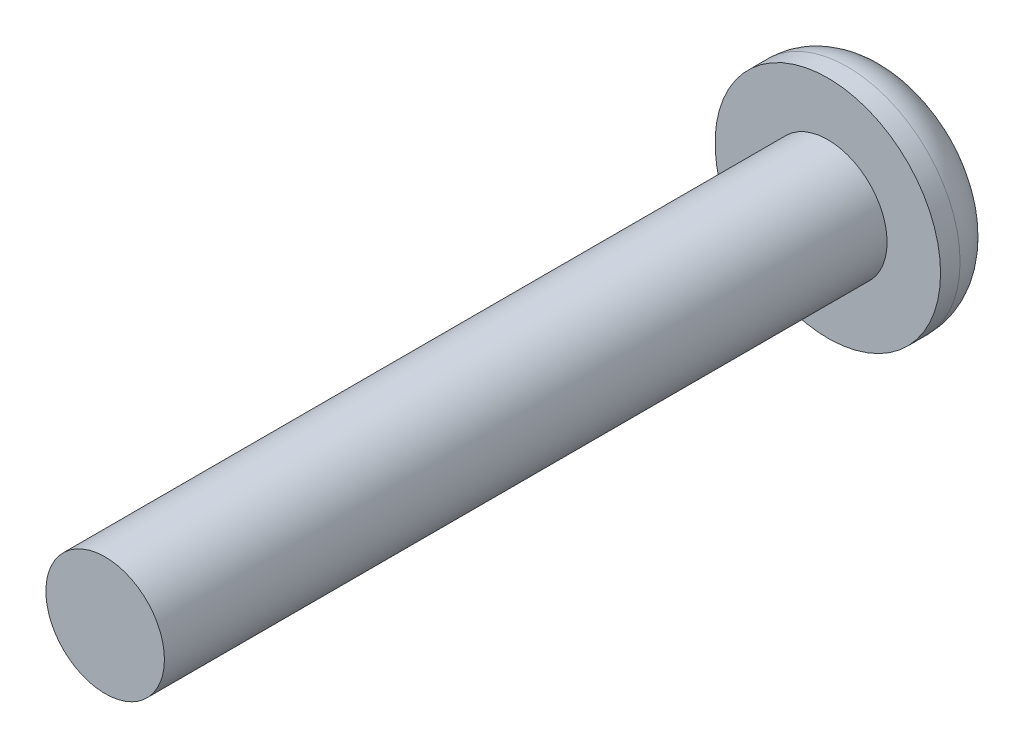
ISO-10303-21;
HEADER;
FILE_DESCRIPTION(('STEP AP214'),'2;1');
FILE_NAME('part.step','',(''),(''),'','','');
FILE_SCHEMA(('AUTOMOTIVE_DESIGN { 1 0 10303 214 1 1 1 1 }'));
ENDSEC;
DATA;
#1=APPLICATION_CONTEXT('core data for automotive mechanical design processes');
#2=APPLICATION_PROTOCOL_DEFINITION('international standard','automotive_design',2000,#1);
#3=PRODUCT_CONTEXT('',#1,'mechanical');
#4=PRODUCT('Part','Part','',(#3));
#5=PRODUCT_RELATED_PRODUCT_CATEGORY('part','',(#4));
#6=PRODUCT_DEFINITION_FORMATION('','',#4);
#7=PRODUCT_DEFINITION_CONTEXT('part definition',#1,'design');
#8=PRODUCT_DEFINITION('design','',#6,#7);
#9=PRODUCT_DEFINITION_SHAPE('','',#8);
#10=(LENGTH_UNIT() NAMED_UNIT(*) SI_UNIT(.MILLI.,.METRE.));
#11=(NAMED_UNIT(*) PLANE_ANGLE_UNIT() SI_UNIT($,.RADIAN.));
#12=(NAMED_UNIT(*) SI_UNIT($,.STERADIAN.) SOLID_ANGLE_UNIT());
#13=UNCERTAINTY_MEASURE_WITH_UNIT(LENGTH_MEASURE(1.E-05),#10,'distance_accuracy_value','');
#14=(GEOMETRIC_REPRESENTATION_CONTEXT(3) GLOBAL_UNCERTAINTY_ASSIGNED_CONTEXT((#13)) GLOBAL_UNIT_ASSIGNED_CONTEXT((#10,
#11,#12)) REPRESENTATION_CONTEXT('',''));
#15=CARTESIAN_POINT('',(0.,0.,0.));
#16=DIRECTION('',(0.,0.,1.));
#17=DIRECTION('',(1.,0.,0.));
#18=AXIS2_PLACEMENT_3D('',#15,#16,#17);
#19=CARTESIAN_POINT('',(0.,0.,2.2098));
#20=DIRECTION('',(0.,0.,1.));
#21=DIRECTION('',(1.,0.,0.));
#22=AXIS2_PLACEMENT_3D('',#19,#20,#21);
#23=PLANE('',#22);
#24=CARTESIAN_POINT('',(0.,0.,2.2098));
#25=DIRECTION('',(0.,0.,1.));
#26=DIRECTION('',(1.,0.,0.));
#27=AXIS2_PLACEMENT_3D('',#24,#25,#26);
#28=CIRCLE('',#27,3.9624);
#29=CARTESIAN_POINT('',(3.9624,0.,2.2098));
#30=VERTEX_POINT('',#29);
#31=EDGE_CURVE('E142',#30,#30,#28,.T.);
#32=ORIENTED_EDGE('',*,*,#31,.T.);
#33=EDGE_LOOP('',(#32));
#34=FACE_BOUND('',#33,.T.);
#35=CARTESIAN_POINT('',(0.,0.,2.2098));
#36=DIRECTION('',(0.,0.,1.));
#37=DIRECTION('',(1.,0.,0.));
#38=AXIS2_PLACEMENT_3D('',#35,#36,#37);
#39=CIRCLE('',#38,2.0828);
#40=CARTESIAN_POINT('',(2.0828,0.,2.2098));
#41=VERTEX_POINT('',#40);
#42=EDGE_CURVE('E133',#41,#41,#39,.T.);
#43=ORIENTED_EDGE('',*,*,#42,.F.);
#44=EDGE_LOOP('',(#43));
#45=FACE_BOUND('',#44,.T.);
#46=ADVANCED_FACE('F31',(#34,#45),#23,.T.);
#47=CARTESIAN_POINT('',(0.,0.,2.2098));
#48=DIRECTION('',(0.,0.,-1.));
#49=DIRECTION('',(-1.,0.,0.));
#50=AXIS2_PLACEMENT_3D('',#47,#48,#49);
#51=CYLINDRICAL_SURFACE('',#50,3.9624);
#52=CARTESIAN_POINT('',(0.,0.,1.524));
#53=DIRECTION('',(0.,0.,1.));
#54=DIRECTION('',(1.,0.,0.));
#55=AXIS2_PLACEMENT_3D('',#52,#53,#54);
#56=CIRCLE('',#55,3.9624);
#57=CARTESIAN_POINT('',(3.9624,0.,1.524));
#58=VERTEX_POINT('',#57);
#59=EDGE_CURVE('E39',#58,#58,#56,.T.);
#60=ORIENTED_EDGE('',*,*,#59,.T.);
#61=EDGE_LOOP('',(#60));
#62=FACE_BOUND('',#61,.T.);
#63=ORIENTED_EDGE('',*,*,#31,.F.);
#64=EDGE_LOOP('',(#63));
#65=FACE_BOUND('',#64,.T.);
#66=ADVANCED_FACE('F149',(#62,#65),#51,.T.);
#67=CARTESIAN_POINT('',(0.,0.,0.));
#68=DIRECTION('',(0.,0.,1.));
#69=DIRECTION('',(1.,0.,0.));
#70=AXIS2_PLACEMENT_3D('',#67,#68,#69);
#71=PLANE('',#70);
#72=DIRECTION('',(0.999833415798117,0.0182521410653723,0.));
#73=VECTOR('',#72,1.);
#74=CARTESIAN_POINT('',(-0.709024608452739,1.17787999902725,0.));
#75=LINE('',#74,#73);
#76=CARTESIAN_POINT('',(-0.709024608452739,1.17787999902725,0.));
#77=VERTEX_POINT('',#76);
#78=CARTESIAN_POINT('',(0.665561697540821,1.20297332234201,0.));
#79=VERTEX_POINT('',#78);
#80=EDGE_CURVE('E120',#77,#79,#75,.T.);
#81=ORIENTED_EDGE('',*,*,#80,.F.);
#82=DIRECTION('',(0.484109890062989,0.875007208166425,0.));
#83=VECTOR('',#82,1.);
#84=CARTESIAN_POINT('',(-1.37458630599356,-0.0250933233147607,0.));
#85=LINE('',#84,#83);
#86=CARTESIAN_POINT('',(-1.37458630599356,-0.0250933233147607,0.));
#87=VERTEX_POINT('',#86);
#88=EDGE_CURVE('E46',#87,#77,#85,.T.);
#89=ORIENTED_EDGE('',*,*,#88,.F.);
#90=DIRECTION('',(-0.515723525735128,0.856755067101052,0.));
#91=VECTOR('',#90,1.);
#92=CARTESIAN_POINT('',(-0.665561697540821,-1.20297332234201,0.));
#93=LINE('',#92,#91);
#94=CARTESIAN_POINT('',(-0.665561697540821,-1.20297332234201,0.));
#95=VERTEX_POINT('',#94);
#96=EDGE_CURVE('E129',#95,#87,#93,.T.);
#97=ORIENTED_EDGE('',*,*,#96,.F.);
#98=DIRECTION('',(-0.999833415798117,-0.0182521410653725,0.));
#99=VECTOR('',#98,1.);
#100=CARTESIAN_POINT('',(0.709024608452739,-1.17787999902725,0.));
#101=LINE('',#100,#99);
#102=CARTESIAN_POINT('',(0.709024608452739,-1.17787999902725,0.));
#103=VERTEX_POINT('',#102);
#104=EDGE_CURVE('E127',#103,#95,#101,.T.);
#105=ORIENTED_EDGE('',*,*,#104,.F.);
#106=DIRECTION('',(-0.484109890062989,-0.875007208166425,0.));
#107=VECTOR('',#106,1.);
#108=CARTESIAN_POINT('',(1.37458630599356,0.0250933233147602,0.));
#109=LINE('',#108,#107);
#110=CARTESIAN_POINT('',(1.37458630599356,0.0250933233147602,0.));
#111=VERTEX_POINT('',#110);
#112=EDGE_CURVE('E94',#111,#103,#109,.T.);
#113=ORIENTED_EDGE('',*,*,#112,.F.);
#114=DIRECTION('',(0.515723525735128,-0.856755067101053,0.));
#115=VECTOR('',#114,1.);
#116=CARTESIAN_POINT('',(0.665561697540821,1.20297332234201,0.));
#117=LINE('',#116,#115);
#118=EDGE_CURVE('E123',#79,#111,#117,.T.);
#119=ORIENTED_EDGE('',*,*,#118,.F.);
#120=EDGE_LOOP('',(#81,#89,#97,#105,#113,#119));
#121=FACE_BOUND('',#120,.T.);
#122=CARTESIAN_POINT('',(0.,0.,0.));
#123=DIRECTION('',(0.,0.,1.));
#124=DIRECTION('',(1.,0.,0.));
#125=AXIS2_PLACEMENT_3D('',#122,#123,#124);
#126=CIRCLE('',#125,2.4384);
#127=CARTESIAN_POINT('',(2.4384,0.,0.));
#128=VERTEX_POINT('',#127);
#129=EDGE_CURVE('E11',#128,#128,#126,.F.);
#130=ORIENTED_EDGE('',*,*,#129,.T.);
#131=EDGE_LOOP('',(#130));
#132=FACE_BOUND('',#131,.T.);
#133=ADVANCED_FACE('F154',(#121,#132),#71,.F.);
#134=CARTESIAN_POINT('',(0.,0.,1.524));
#135=DIRECTION('',(0.,0.,1.));
#136=DIRECTION('',(1.,0.,0.));
#137=AXIS2_PLACEMENT_3D('',#134,#135,#136);
#138=TOROIDAL_SURFACE('',#137,2.4384,1.524);
#139=ORIENTED_EDGE('',*,*,#129,.F.);
#140=EDGE_LOOP('',(#139));
#141=FACE_BOUND('',#140,.T.);
#142=ORIENTED_EDGE('',*,*,#59,.F.);
#143=EDGE_LOOP('',(#142));
#144=FACE_BOUND('',#143,.T.);
#145=ADVANCED_FACE('F33',(#141,#144),#138,.T.);
#146=CARTESIAN_POINT('',(0.,0.,27.6098));
#147=DIRECTION('',(0.,0.,-1.));
#148=DIRECTION('',(-1.,0.,0.));
#149=AXIS2_PLACEMENT_3D('',#146,#147,#148);
#150=CYLINDRICAL_SURFACE('',#149,2.0828);
#151=CARTESIAN_POINT('',(0.,0.,27.6098));
#152=DIRECTION('',(0.,0.,1.));
#153=DIRECTION('',(1.,0.,0.));
#154=AXIS2_PLACEMENT_3D('',#151,#152,#153);
#155=CIRCLE('',#154,2.0828);
#156=CARTESIAN_POINT('',(2.0828,0.,27.6098));
#157=VERTEX_POINT('',#156);
#158=EDGE_CURVE('E139',#157,#157,#155,.T.);
#159=ORIENTED_EDGE('',*,*,#158,.F.);
#160=EDGE_LOOP('',(#159));
#161=FACE_BOUND('',#160,.T.);
#162=ORIENTED_EDGE('',*,*,#42,.T.);
#163=EDGE_LOOP('',(#162));
#164=FACE_BOUND('',#163,.T.);
#165=ADVANCED_FACE('F153',(#161,#164),#150,.T.);
#166=CARTESIAN_POINT('',(0.,0.,27.6098));
#167=DIRECTION('',(0.,0.,1.));
#168=DIRECTION('',(1.,0.,0.));
#169=AXIS2_PLACEMENT_3D('',#166,#167,#168);
#170=PLANE('',#169);
#171=ORIENTED_EDGE('',*,*,#158,.T.);
#172=EDGE_LOOP('',(#171));
#173=FACE_BOUND('',#172,.T.);
#174=ADVANCED_FACE('F160',(#173),#170,.T.);
#175=CARTESIAN_POINT('',(-1.37458630599356,-0.0250933233147607,1.016));
#176=DIRECTION('',(-0.875007208166425,0.484109890062989,0.));
#177=DIRECTION('',(-0.484109890062989,-0.875007208166425,0.));
#178=AXIS2_PLACEMENT_3D('',#175,#176,#177);
#179=PLANE('',#178);
#180=ORIENTED_EDGE('',*,*,#88,.T.);
#181=DIRECTION('',(0.,0.,-1.));
#182=VECTOR('',#181,1.);
#183=CARTESIAN_POINT('',(-0.709024608452739,1.17787999902725,1.016));
#184=LINE('',#183,#182);
#185=CARTESIAN_POINT('',(-0.709024608452739,1.17787999902725,1.016));
#186=VERTEX_POINT('',#185);
#187=EDGE_CURVE('E76',#186,#77,#184,.T.);
#188=ORIENTED_EDGE('',*,*,#187,.F.);
#189=DIRECTION('',(0.484109890062989,0.875007208166425,0.));
#190=VECTOR('',#189,1.);
#191=CARTESIAN_POINT('',(-1.37458630599356,-0.0250933233147607,1.016));
#192=LINE('',#191,#190);
#193=CARTESIAN_POINT('',(-1.37458630599356,-0.0250933233147607,1.016));
#194=VERTEX_POINT('',#193);
#195=EDGE_CURVE('E131',#194,#186,#192,.T.);
#196=ORIENTED_EDGE('',*,*,#195,.F.);
#197=DIRECTION('',(0.,0.,-1.));
#198=VECTOR('',#197,1.);
#199=CARTESIAN_POINT('',(-1.37458630599356,-0.0250933233147607,1.016));
#200=LINE('',#199,#198);
#201=EDGE_CURVE('E54',#194,#87,#200,.T.);
#202=ORIENTED_EDGE('',*,*,#201,.T.);
#203=EDGE_LOOP('',(#180,#188,#196,#202));
#204=FACE_BOUND('',#203,.T.);
#205=ADVANCED_FACE('F176',(#204),#179,.F.);
#206=CARTESIAN_POINT('',(-0.665561697540821,-1.20297332234201,1.016));
#207=DIRECTION('',(-0.856755067101053,-0.515723525735128,0.));
#208=DIRECTION('',(0.515723525735128,-0.856755067101052,0.));
#209=AXIS2_PLACEMENT_3D('',#206,#207,#208);
#210=PLANE('',#209);
#211=ORIENTED_EDGE('',*,*,#96,.T.);
#212=ORIENTED_EDGE('',*,*,#201,.F.);
#213=DIRECTION('',(-0.515723525735128,0.856755067101052,0.));
#214=VECTOR('',#213,1.);
#215=CARTESIAN_POINT('',(-0.665561697540821,-1.20297332234201,1.016));
#216=LINE('',#215,#214);
#217=CARTESIAN_POINT('',(-0.665561697540821,-1.20297332234201,1.016));
#218=VERTEX_POINT('',#217);
#219=EDGE_CURVE('E106',#218,#194,#216,.T.);
#220=ORIENTED_EDGE('',*,*,#219,.F.);
#221=DIRECTION('',(0.,0.,-1.));
#222=VECTOR('',#221,1.);
#223=CARTESIAN_POINT('',(-0.665561697540821,-1.20297332234201,1.016));
#224=LINE('',#223,#222);
#225=EDGE_CURVE('E98',#218,#95,#224,.T.);
#226=ORIENTED_EDGE('',*,*,#225,.T.);
#227=EDGE_LOOP('',(#211,#212,#220,#226));
#228=FACE_BOUND('',#227,.T.);
#229=ADVANCED_FACE('F180',(#228),#210,.F.);
#230=CARTESIAN_POINT('',(0.709024608452739,-1.17787999902725,1.016));
#231=DIRECTION('',(0.0182521410653725,-0.999833415798117,0.));
#232=DIRECTION('',(0.999833415798117,0.0182521410653725,0.));
#233=AXIS2_PLACEMENT_3D('',#230,#231,#232);
#234=PLANE('',#233);
#235=ORIENTED_EDGE('',*,*,#104,.T.);
#236=ORIENTED_EDGE('',*,*,#225,.F.);
#237=DIRECTION('',(-0.999833415798117,-0.0182521410653725,0.));
#238=VECTOR('',#237,1.);
#239=CARTESIAN_POINT('',(0.709024608452739,-1.17787999902725,1.016));
#240=LINE('',#239,#238);
#241=CARTESIAN_POINT('',(0.709024608452739,-1.17787999902725,1.016));
#242=VERTEX_POINT('',#241);
#243=EDGE_CURVE('E102',#242,#218,#240,.T.);
#244=ORIENTED_EDGE('',*,*,#243,.F.);
#245=DIRECTION('',(0.,0.,-1.));
#246=VECTOR('',#245,1.);
#247=CARTESIAN_POINT('',(0.709024608452739,-1.17787999902725,1.016));
#248=LINE('',#247,#246);
#249=EDGE_CURVE('E87',#242,#103,#248,.T.);
#250=ORIENTED_EDGE('',*,*,#249,.T.);
#251=EDGE_LOOP('',(#235,#236,#244,#250));
#252=FACE_BOUND('',#251,.T.);
#253=ADVANCED_FACE('F103',(#252),#234,.F.);
#254=CARTESIAN_POINT('',(1.37458630599356,0.0250933233147602,1.016));
#255=DIRECTION('',(0.875007208166425,-0.484109890062989,0.));
#256=DIRECTION('',(0.484109890062989,0.875007208166425,0.));
#257=AXIS2_PLACEMENT_3D('',#254,#255,#256);
#258=PLANE('',#257);
#259=ORIENTED_EDGE('',*,*,#112,.T.);
#260=ORIENTED_EDGE('',*,*,#249,.F.);
#261=DIRECTION('',(-0.484109890062989,-0.875007208166425,0.));
#262=VECTOR('',#261,1.);
#263=CARTESIAN_POINT('',(1.37458630599356,0.0250933233147602,1.016));
#264=LINE('',#263,#262);
#265=CARTESIAN_POINT('',(1.37458630599356,0.0250933233147602,1.016));
#266=VERTEX_POINT('',#265);
#267=EDGE_CURVE('E91',#266,#242,#264,.T.);
#268=ORIENTED_EDGE('',*,*,#267,.F.);
#269=DIRECTION('',(0.,0.,-1.));
#270=VECTOR('',#269,1.);
#271=CARTESIAN_POINT('',(1.37458630599356,0.0250933233147602,1.016));
#272=LINE('',#271,#270);
#273=EDGE_CURVE('E99',#266,#111,#272,.T.);
#274=ORIENTED_EDGE('',*,*,#273,.T.);
#275=EDGE_LOOP('',(#259,#260,#268,#274));
#276=FACE_BOUND('',#275,.T.);
#277=ADVANCED_FACE('F89',(#276),#258,.F.);
#278=CARTESIAN_POINT('',(0.665561697540821,1.20297332234201,1.016));
#279=DIRECTION('',(0.856755067101053,0.515723525735128,0.));
#280=DIRECTION('',(-0.515723525735128,0.856755067101052,0.));
#281=AXIS2_PLACEMENT_3D('',#278,#279,#280);
#282=PLANE('',#281);
#283=ORIENTED_EDGE('',*,*,#118,.T.);
#284=ORIENTED_EDGE('',*,*,#273,.F.);
#285=DIRECTION('',(0.515723525735128,-0.856755067101053,0.));
#286=VECTOR('',#285,1.);
#287=CARTESIAN_POINT('',(0.665561697540821,1.20297332234201,1.016));
#288=LINE('',#287,#286);
#289=CARTESIAN_POINT('',(0.665561697540821,1.20297332234201,1.016));
#290=VERTEX_POINT('',#289);
#291=EDGE_CURVE('E112',#290,#266,#288,.T.);
#292=ORIENTED_EDGE('',*,*,#291,.F.);
#293=DIRECTION('',(0.,0.,-1.));
#294=VECTOR('',#293,1.);
#295=CARTESIAN_POINT('',(0.665561697540821,1.20297332234201,1.016));
#296=LINE('',#295,#294);
#297=EDGE_CURVE('E136',#290,#79,#296,.T.);
#298=ORIENTED_EDGE('',*,*,#297,.T.);
#299=EDGE_LOOP('',(#283,#284,#292,#298));
#300=FACE_BOUND('',#299,.T.);
#301=ADVANCED_FACE('F184',(#300),#282,.F.);
#302=CARTESIAN_POINT('',(-0.709024608452739,1.17787999902725,1.016));
#303=DIRECTION('',(-0.0182521410653723,0.999833415798117,0.));
#304=DIRECTION('',(-0.999833415798117,-0.0182521410653723,0.));
#305=AXIS2_PLACEMENT_3D('',#302,#303,#304);
#306=PLANE('',#305);
#307=ORIENTED_EDGE('',*,*,#80,.T.);
#308=ORIENTED_EDGE('',*,*,#297,.F.);
#309=DIRECTION('',(0.999833415798117,0.0182521410653723,0.));
#310=VECTOR('',#309,1.);
#311=CARTESIAN_POINT('',(-0.709024608452739,1.17787999902725,1.016));
#312=LINE('',#311,#310);
#313=EDGE_CURVE('E114',#186,#290,#312,.T.);
#314=ORIENTED_EDGE('',*,*,#313,.F.);
#315=ORIENTED_EDGE('',*,*,#187,.T.);
#316=EDGE_LOOP('',(#307,#308,#314,#315));
#317=FACE_BOUND('',#316,.T.);
#318=ADVANCED_FACE('F181',(#317),#306,.F.);
#319=CARTESIAN_POINT('',(-0.709024608452739,1.17787999902725,1.016));
#320=DIRECTION('',(0.,0.,-1.));
#321=DIRECTION('',(-1.,0.,0.));
#322=AXIS2_PLACEMENT_3D('',#319,#320,#321);
#323=PLANE('',#322);
#324=ORIENTED_EDGE('',*,*,#195,.T.);
#325=ORIENTED_EDGE('',*,*,#313,.T.);
#326=ORIENTED_EDGE('',*,*,#291,.T.);
#327=ORIENTED_EDGE('',*,*,#267,.T.);
#328=ORIENTED_EDGE('',*,*,#243,.T.);
#329=ORIENTED_EDGE('',*,*,#219,.T.);
#330=EDGE_LOOP('',(#324,#325,#326,#327,#328,#329));
#331=FACE_BOUND('',#330,.T.);
#332=ADVANCED_FACE('F109',(#331),#323,.T.);
#333=CLOSED_SHELL('',(#46,#66,#133,#145,#165,#174,#205,#229,#253,#277,#301,#318,#332));
#334=MANIFOLD_SOLID_BREP('B2',#333);
#335=ADVANCED_BREP_SHAPE_REPRESENTATION('',(#18,#334),#14);
#336=SHAPE_DEFINITION_REPRESENTATION(#9,#335);
ENDSEC;
END-ISO-10303-21;
